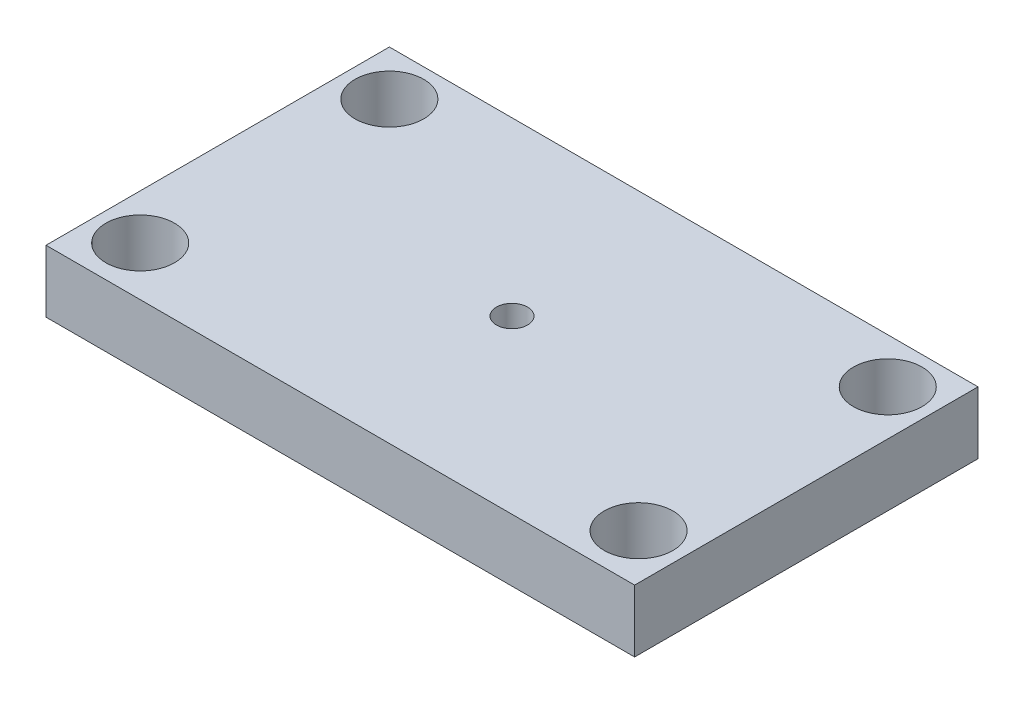
ISO-10303-21;
HEADER;
FILE_DESCRIPTION(('STEP AP214'),'2;1');
FILE_NAME('part.step','',(''),(''),'','','');
FILE_SCHEMA(('AUTOMOTIVE_DESIGN { 1 0 10303 214 1 1 1 1 }'));
ENDSEC;
DATA;
#1=APPLICATION_CONTEXT('core data for automotive mechanical design processes');
#2=APPLICATION_PROTOCOL_DEFINITION('international standard','automotive_design',2000,#1);
#3=PRODUCT_CONTEXT('',#1,'mechanical');
#4=PRODUCT('Part','Part','',(#3));
#5=PRODUCT_RELATED_PRODUCT_CATEGORY('part','',(#4));
#6=PRODUCT_DEFINITION_FORMATION('','',#4);
#7=PRODUCT_DEFINITION_CONTEXT('part definition',#1,'design');
#8=PRODUCT_DEFINITION('design','',#6,#7);
#9=PRODUCT_DEFINITION_SHAPE('','',#8);
#10=(LENGTH_UNIT() NAMED_UNIT(*) SI_UNIT(.MILLI.,.METRE.));
#11=(NAMED_UNIT(*) PLANE_ANGLE_UNIT() SI_UNIT($,.RADIAN.));
#12=(NAMED_UNIT(*) SI_UNIT($,.STERADIAN.) SOLID_ANGLE_UNIT());
#13=UNCERTAINTY_MEASURE_WITH_UNIT(LENGTH_MEASURE(1.E-05),#10,'distance_accuracy_value','');
#14=(GEOMETRIC_REPRESENTATION_CONTEXT(3) GLOBAL_UNCERTAINTY_ASSIGNED_CONTEXT((#13)) GLOBAL_UNIT_ASSIGNED_CONTEXT((#10,
#11,#12)) REPRESENTATION_CONTEXT('',''));
#15=CARTESIAN_POINT('',(0.,0.,0.));
#16=DIRECTION('',(0.,0.,1.));
#17=DIRECTION('',(1.,0.,0.));
#18=AXIS2_PLACEMENT_3D('',#15,#16,#17);
#19=CARTESIAN_POINT('',(0.,6.35,0.));
#20=DIRECTION('',(0.,-1.,0.));
#21=DIRECTION('',(0.,0.,-1.));
#22=AXIS2_PLACEMENT_3D('',#19,#20,#21);
#23=PLANE('',#22);
#24=DIRECTION('',(0.,0.,1.));
#25=VECTOR('',#24,1.);
#26=CARTESIAN_POINT('',(0.,6.35,0.));
#27=LINE('',#26,#25);
#28=CARTESIAN_POINT('',(0.,6.35,-35.));
#29=VERTEX_POINT('',#28);
#30=CARTESIAN_POINT('',(0.,6.35,0.));
#31=VERTEX_POINT('',#30);
#32=EDGE_CURVE('E96',#29,#31,#27,.T.);
#33=ORIENTED_EDGE('',*,*,#32,.T.);
#34=DIRECTION('',(1.,0.,0.));
#35=VECTOR('',#34,1.);
#36=CARTESIAN_POINT('',(0.,6.35,0.));
#37=LINE('',#36,#35);
#38=CARTESIAN_POINT('',(60.,6.35,0.));
#39=VERTEX_POINT('',#38);
#40=EDGE_CURVE('E91',#31,#39,#37,.T.);
#41=ORIENTED_EDGE('',*,*,#40,.T.);
#42=DIRECTION('',(0.,0.,-1.));
#43=VECTOR('',#42,1.);
#44=CARTESIAN_POINT('',(60.,6.35,0.));
#45=LINE('',#44,#43);
#46=CARTESIAN_POINT('',(60.,6.35,-35.));
#47=VERTEX_POINT('',#46);
#48=EDGE_CURVE('E94',#39,#47,#45,.T.);
#49=ORIENTED_EDGE('',*,*,#48,.T.);
#50=DIRECTION('',(-1.,0.,0.));
#51=VECTOR('',#50,1.);
#52=CARTESIAN_POINT('',(0.,6.35,-35.));
#53=LINE('',#52,#51);
#54=EDGE_CURVE('E61',#47,#29,#53,.T.);
#55=ORIENTED_EDGE('',*,*,#54,.T.);
#56=EDGE_LOOP('',(#33,#41,#49,#55));
#57=FACE_BOUND('',#56,.T.);
#58=CARTESIAN_POINT('',(4.6,6.35,-30.4));
#59=DIRECTION('',(0.,1.,0.));
#60=DIRECTION('',(0.,0.,1.));
#61=AXIS2_PLACEMENT_3D('',#58,#59,#60);
#62=CIRCLE('',#61,3.5);
#63=CARTESIAN_POINT('',(4.6,6.35,-26.9));
#64=VERTEX_POINT('',#63);
#65=EDGE_CURVE('E116',#64,#64,#62,.T.);
#66=ORIENTED_EDGE('',*,*,#65,.F.);
#67=EDGE_LOOP('',(#66));
#68=FACE_BOUND('',#67,.T.);
#69=CARTESIAN_POINT('',(55.4,6.35,-30.4));
#70=DIRECTION('',(0.,1.,0.));
#71=DIRECTION('',(0.,0.,1.));
#72=AXIS2_PLACEMENT_3D('',#69,#70,#71);
#73=CIRCLE('',#72,3.5);
#74=CARTESIAN_POINT('',(55.4,6.35,-26.9));
#75=VERTEX_POINT('',#74);
#76=EDGE_CURVE('E138',#75,#75,#73,.T.);
#77=ORIENTED_EDGE('',*,*,#76,.F.);
#78=EDGE_LOOP('',(#77));
#79=FACE_BOUND('',#78,.T.);
#80=CARTESIAN_POINT('',(4.6,6.35,-5.));
#81=DIRECTION('',(0.,1.,0.));
#82=DIRECTION('',(0.,0.,1.));
#83=AXIS2_PLACEMENT_3D('',#80,#81,#82);
#84=CIRCLE('',#83,3.5);
#85=CARTESIAN_POINT('',(4.6,6.35,-1.5));
#86=VERTEX_POINT('',#85);
#87=EDGE_CURVE('E146',#86,#86,#84,.T.);
#88=ORIENTED_EDGE('',*,*,#87,.F.);
#89=EDGE_LOOP('',(#88));
#90=FACE_BOUND('',#89,.T.);
#91=CARTESIAN_POINT('',(55.4,6.35,-5.));
#92=DIRECTION('',(0.,1.,0.));
#93=DIRECTION('',(0.,0.,1.));
#94=AXIS2_PLACEMENT_3D('',#91,#92,#93);
#95=CIRCLE('',#94,3.5);
#96=CARTESIAN_POINT('',(55.4,6.35,-1.5));
#97=VERTEX_POINT('',#96);
#98=EDGE_CURVE('E154',#97,#97,#95,.T.);
#99=ORIENTED_EDGE('',*,*,#98,.F.);
#100=EDGE_LOOP('',(#99));
#101=FACE_BOUND('',#100,.T.);
#102=CARTESIAN_POINT('',(30.,6.35,-17.5));
#103=DIRECTION('',(0.,1.,0.));
#104=DIRECTION('',(0.,0.,1.));
#105=AXIS2_PLACEMENT_3D('',#102,#103,#104);
#106=CIRCLE('',#105,1.5875);
#107=CARTESIAN_POINT('',(30.,6.35,-15.9125));
#108=VERTEX_POINT('',#107);
#109=EDGE_CURVE('E162',#108,#108,#106,.T.);
#110=ORIENTED_EDGE('',*,*,#109,.F.);
#111=EDGE_LOOP('',(#110));
#112=FACE_BOUND('',#111,.T.);
#113=ADVANCED_FACE('F43',(#57,#68,#79,#90,#101,#112),#23,.F.);
#114=CARTESIAN_POINT('',(0.,0.,0.));
#115=DIRECTION('',(0.,-1.,0.));
#116=DIRECTION('',(0.,0.,-1.));
#117=AXIS2_PLACEMENT_3D('',#114,#115,#116);
#118=PLANE('',#117);
#119=CARTESIAN_POINT('',(55.4,0.,-5.));
#120=DIRECTION('',(0.,1.,0.));
#121=DIRECTION('',(0.,0.,1.));
#122=AXIS2_PLACEMENT_3D('',#119,#120,#121);
#123=CIRCLE('',#122,3.5);
#124=CARTESIAN_POINT('',(55.4,0.,-1.5));
#125=VERTEX_POINT('',#124);
#126=EDGE_CURVE('E158',#125,#125,#123,.T.);
#127=ORIENTED_EDGE('',*,*,#126,.T.);
#128=EDGE_LOOP('',(#127));
#129=FACE_BOUND('',#128,.T.);
#130=CARTESIAN_POINT('',(55.4,0.,-30.4));
#131=DIRECTION('',(0.,1.,0.));
#132=DIRECTION('',(0.,0.,1.));
#133=AXIS2_PLACEMENT_3D('',#130,#131,#132);
#134=CIRCLE('',#133,3.5);
#135=CARTESIAN_POINT('',(55.4,0.,-26.9));
#136=VERTEX_POINT('',#135);
#137=EDGE_CURVE('E142',#136,#136,#134,.T.);
#138=ORIENTED_EDGE('',*,*,#137,.T.);
#139=EDGE_LOOP('',(#138));
#140=FACE_BOUND('',#139,.T.);
#141=DIRECTION('',(0.,0.,1.));
#142=VECTOR('',#141,1.);
#143=CARTESIAN_POINT('',(0.,0.,0.));
#144=LINE('',#143,#142);
#145=CARTESIAN_POINT('',(0.,0.,-35.));
#146=VERTEX_POINT('',#145);
#147=CARTESIAN_POINT('',(0.,0.,0.));
#148=VERTEX_POINT('',#147);
#149=EDGE_CURVE('E112',#146,#148,#144,.T.);
#150=ORIENTED_EDGE('',*,*,#149,.F.);
#151=DIRECTION('',(-1.,0.,0.));
#152=VECTOR('',#151,1.);
#153=CARTESIAN_POINT('',(0.,0.,-35.));
#154=LINE('',#153,#152);
#155=CARTESIAN_POINT('',(60.,0.,-35.));
#156=VERTEX_POINT('',#155);
#157=EDGE_CURVE('E84',#156,#146,#154,.T.);
#158=ORIENTED_EDGE('',*,*,#157,.F.);
#159=DIRECTION('',(0.,0.,-1.));
#160=VECTOR('',#159,1.);
#161=CARTESIAN_POINT('',(60.,0.,0.));
#162=LINE('',#161,#160);
#163=CARTESIAN_POINT('',(60.,0.,0.));
#164=VERTEX_POINT('',#163);
#165=EDGE_CURVE('E78',#164,#156,#162,.T.);
#166=ORIENTED_EDGE('',*,*,#165,.F.);
#167=DIRECTION('',(1.,0.,0.));
#168=VECTOR('',#167,1.);
#169=CARTESIAN_POINT('',(0.,0.,0.));
#170=LINE('',#169,#168);
#171=EDGE_CURVE('E101',#148,#164,#170,.T.);
#172=ORIENTED_EDGE('',*,*,#171,.F.);
#173=EDGE_LOOP('',(#150,#158,#166,#172));
#174=FACE_BOUND('',#173,.T.);
#175=CARTESIAN_POINT('',(4.6,0.,-30.4));
#176=DIRECTION('',(0.,1.,0.));
#177=DIRECTION('',(0.,0.,1.));
#178=AXIS2_PLACEMENT_3D('',#175,#176,#177);
#179=CIRCLE('',#178,3.5);
#180=CARTESIAN_POINT('',(4.6,0.,-26.9));
#181=VERTEX_POINT('',#180);
#182=EDGE_CURVE('E134',#181,#181,#179,.T.);
#183=ORIENTED_EDGE('',*,*,#182,.T.);
#184=EDGE_LOOP('',(#183));
#185=FACE_BOUND('',#184,.T.);
#186=CARTESIAN_POINT('',(4.6,0.,-5.));
#187=DIRECTION('',(0.,1.,0.));
#188=DIRECTION('',(0.,0.,1.));
#189=AXIS2_PLACEMENT_3D('',#186,#187,#188);
#190=CIRCLE('',#189,3.5);
#191=CARTESIAN_POINT('',(4.6,0.,-1.5));
#192=VERTEX_POINT('',#191);
#193=EDGE_CURVE('E150',#192,#192,#190,.T.);
#194=ORIENTED_EDGE('',*,*,#193,.T.);
#195=EDGE_LOOP('',(#194));
#196=FACE_BOUND('',#195,.T.);
#197=CARTESIAN_POINT('',(30.,0.,-17.5));
#198=DIRECTION('',(0.,1.,0.));
#199=DIRECTION('',(0.,0.,1.));
#200=AXIS2_PLACEMENT_3D('',#197,#198,#199);
#201=CIRCLE('',#200,1.5875);
#202=CARTESIAN_POINT('',(30.,0.,-15.9125));
#203=VERTEX_POINT('',#202);
#204=EDGE_CURVE('E166',#203,#203,#201,.T.);
#205=ORIENTED_EDGE('',*,*,#204,.T.);
#206=EDGE_LOOP('',(#205));
#207=FACE_BOUND('',#206,.T.);
#208=ADVANCED_FACE('F129',(#129,#140,#174,#185,#196,#207),#118,.T.);
#209=CARTESIAN_POINT('',(0.,6.35,0.));
#210=DIRECTION('',(1.,0.,0.));
#211=DIRECTION('',(0.,0.,-1.));
#212=AXIS2_PLACEMENT_3D('',#209,#210,#211);
#213=PLANE('',#212);
#214=ORIENTED_EDGE('',*,*,#149,.T.);
#215=DIRECTION('',(0.,-1.,0.));
#216=VECTOR('',#215,1.);
#217=CARTESIAN_POINT('',(0.,6.35,0.));
#218=LINE('',#217,#216);
#219=EDGE_CURVE('E11',#31,#148,#218,.T.);
#220=ORIENTED_EDGE('',*,*,#219,.F.);
#221=ORIENTED_EDGE('',*,*,#32,.F.);
#222=DIRECTION('',(0.,-1.,0.));
#223=VECTOR('',#222,1.);
#224=CARTESIAN_POINT('',(0.,6.35,-35.));
#225=LINE('',#224,#223);
#226=EDGE_CURVE('E108',#29,#146,#225,.T.);
#227=ORIENTED_EDGE('',*,*,#226,.T.);
#228=EDGE_LOOP('',(#214,#220,#221,#227));
#229=FACE_BOUND('',#228,.T.);
#230=ADVANCED_FACE('F45',(#229),#213,.F.);
#231=CARTESIAN_POINT('',(0.,6.35,0.));
#232=DIRECTION('',(0.,0.,-1.));
#233=DIRECTION('',(-1.,0.,0.));
#234=AXIS2_PLACEMENT_3D('',#231,#232,#233);
#235=PLANE('',#234);
#236=ORIENTED_EDGE('',*,*,#171,.T.);
#237=DIRECTION('',(0.,-1.,0.));
#238=VECTOR('',#237,1.);
#239=CARTESIAN_POINT('',(60.,6.35,0.));
#240=LINE('',#239,#238);
#241=EDGE_CURVE('E53',#39,#164,#240,.T.);
#242=ORIENTED_EDGE('',*,*,#241,.F.);
#243=ORIENTED_EDGE('',*,*,#40,.F.);
#244=ORIENTED_EDGE('',*,*,#219,.T.);
#245=EDGE_LOOP('',(#236,#242,#243,#244));
#246=FACE_BOUND('',#245,.T.);
#247=ADVANCED_FACE('F100',(#246),#235,.F.);
#248=CARTESIAN_POINT('',(60.,6.35,0.));
#249=DIRECTION('',(-1.,0.,0.));
#250=DIRECTION('',(0.,0.,1.));
#251=AXIS2_PLACEMENT_3D('',#248,#249,#250);
#252=PLANE('',#251);
#253=ORIENTED_EDGE('',*,*,#165,.T.);
#254=DIRECTION('',(0.,-1.,0.));
#255=VECTOR('',#254,1.);
#256=CARTESIAN_POINT('',(60.,6.35,-35.));
#257=LINE('',#256,#255);
#258=EDGE_CURVE('E103',#47,#156,#257,.T.);
#259=ORIENTED_EDGE('',*,*,#258,.F.);
#260=ORIENTED_EDGE('',*,*,#48,.F.);
#261=ORIENTED_EDGE('',*,*,#241,.T.);
#262=EDGE_LOOP('',(#253,#259,#260,#261));
#263=FACE_BOUND('',#262,.T.);
#264=ADVANCED_FACE('F104',(#263),#252,.F.);
#265=CARTESIAN_POINT('',(0.,6.35,-35.));
#266=DIRECTION('',(0.,0.,1.));
#267=DIRECTION('',(1.,0.,0.));
#268=AXIS2_PLACEMENT_3D('',#265,#266,#267);
#269=PLANE('',#268);
#270=ORIENTED_EDGE('',*,*,#157,.T.);
#271=ORIENTED_EDGE('',*,*,#226,.F.);
#272=ORIENTED_EDGE('',*,*,#54,.F.);
#273=ORIENTED_EDGE('',*,*,#258,.T.);
#274=EDGE_LOOP('',(#270,#271,#272,#273));
#275=FACE_BOUND('',#274,.T.);
#276=ADVANCED_FACE('F126',(#275),#269,.F.);
#277=CARTESIAN_POINT('',(4.6,6.35,-30.4));
#278=DIRECTION('',(0.,-1.,0.));
#279=DIRECTION('',(0.,0.,-1.));
#280=AXIS2_PLACEMENT_3D('',#277,#278,#279);
#281=CYLINDRICAL_SURFACE('',#280,3.5);
#282=ORIENTED_EDGE('',*,*,#65,.T.);
#283=EDGE_LOOP('',(#282));
#284=FACE_BOUND('',#283,.T.);
#285=ORIENTED_EDGE('',*,*,#182,.F.);
#286=EDGE_LOOP('',(#285));
#287=FACE_BOUND('',#286,.T.);
#288=ADVANCED_FACE('F185',(#284,#287),#281,.F.);
#289=CARTESIAN_POINT('',(55.4,6.35,-30.4));
#290=DIRECTION('',(0.,-1.,0.));
#291=DIRECTION('',(0.,0.,-1.));
#292=AXIS2_PLACEMENT_3D('',#289,#290,#291);
#293=CYLINDRICAL_SURFACE('',#292,3.5);
#294=ORIENTED_EDGE('',*,*,#76,.T.);
#295=EDGE_LOOP('',(#294));
#296=FACE_BOUND('',#295,.T.);
#297=ORIENTED_EDGE('',*,*,#137,.F.);
#298=EDGE_LOOP('',(#297));
#299=FACE_BOUND('',#298,.T.);
#300=ADVANCED_FACE('F239',(#296,#299),#293,.F.);
#301=CARTESIAN_POINT('',(4.6,6.35,-5.));
#302=DIRECTION('',(0.,-1.,0.));
#303=DIRECTION('',(0.,0.,-1.));
#304=AXIS2_PLACEMENT_3D('',#301,#302,#303);
#305=CYLINDRICAL_SURFACE('',#304,3.5);
#306=ORIENTED_EDGE('',*,*,#87,.T.);
#307=EDGE_LOOP('',(#306));
#308=FACE_BOUND('',#307,.T.);
#309=ORIENTED_EDGE('',*,*,#193,.F.);
#310=EDGE_LOOP('',(#309));
#311=FACE_BOUND('',#310,.T.);
#312=ADVANCED_FACE('F248',(#308,#311),#305,.F.);
#313=CARTESIAN_POINT('',(55.4,6.35,-5.));
#314=DIRECTION('',(0.,-1.,0.));
#315=DIRECTION('',(0.,0.,-1.));
#316=AXIS2_PLACEMENT_3D('',#313,#314,#315);
#317=CYLINDRICAL_SURFACE('',#316,3.5);
#318=ORIENTED_EDGE('',*,*,#98,.T.);
#319=EDGE_LOOP('',(#318));
#320=FACE_BOUND('',#319,.T.);
#321=ORIENTED_EDGE('',*,*,#126,.F.);
#322=EDGE_LOOP('',(#321));
#323=FACE_BOUND('',#322,.T.);
#324=ADVANCED_FACE('F257',(#320,#323),#317,.F.);
#325=CARTESIAN_POINT('',(30.,6.35,-17.5));
#326=DIRECTION('',(0.,-1.,0.));
#327=DIRECTION('',(0.,0.,-1.));
#328=AXIS2_PLACEMENT_3D('',#325,#326,#327);
#329=CYLINDRICAL_SURFACE('',#328,1.5875);
#330=ORIENTED_EDGE('',*,*,#109,.T.);
#331=EDGE_LOOP('',(#330));
#332=FACE_BOUND('',#331,.T.);
#333=ORIENTED_EDGE('',*,*,#204,.F.);
#334=EDGE_LOOP('',(#333));
#335=FACE_BOUND('',#334,.T.);
#336=ADVANCED_FACE('F174',(#332,#335),#329,.F.);
#337=CLOSED_SHELL('',(#113,#208,#230,#247,#264,#276,#288,#300,#312,#324,#336));
#338=MANIFOLD_SOLID_BREP('B2',#337);
#339=ADVANCED_BREP_SHAPE_REPRESENTATION('',(#18,#338),#14);
#340=SHAPE_DEFINITION_REPRESENTATION(#9,#339);
ENDSEC;
END-ISO-10303-21;
